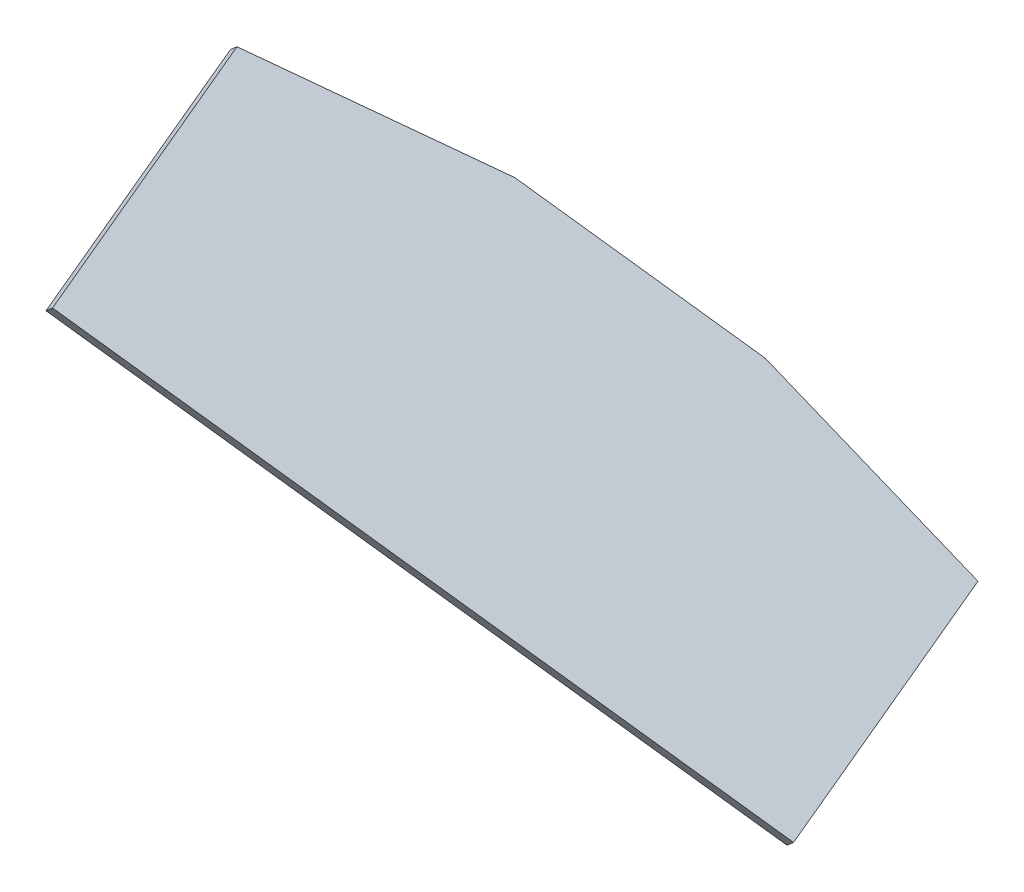
ISO-10303-21;
HEADER;
FILE_DESCRIPTION(('STEP AP214'),'2;1');
FILE_NAME('part.step','',(''),(''),'','','');
FILE_SCHEMA(('AUTOMOTIVE_DESIGN { 1 0 10303 214 1 1 1 1 }'));
ENDSEC;
DATA;
#1=APPLICATION_CONTEXT('core data for automotive mechanical design processes');
#2=APPLICATION_PROTOCOL_DEFINITION('international standard','automotive_design',2000,#1);
#3=PRODUCT_CONTEXT('',#1,'mechanical');
#4=PRODUCT('Part','Part','',(#3));
#5=PRODUCT_RELATED_PRODUCT_CATEGORY('part','',(#4));
#6=PRODUCT_DEFINITION_FORMATION('','',#4);
#7=PRODUCT_DEFINITION_CONTEXT('part definition',#1,'design');
#8=PRODUCT_DEFINITION('design','',#6,#7);
#9=PRODUCT_DEFINITION_SHAPE('','',#8);
#10=(LENGTH_UNIT() NAMED_UNIT(*) SI_UNIT(.MILLI.,.METRE.));
#11=(NAMED_UNIT(*) PLANE_ANGLE_UNIT() SI_UNIT($,.RADIAN.));
#12=(NAMED_UNIT(*) SI_UNIT($,.STERADIAN.) SOLID_ANGLE_UNIT());
#13=UNCERTAINTY_MEASURE_WITH_UNIT(LENGTH_MEASURE(1.E-05),#10,'distance_accuracy_value','');
#14=(GEOMETRIC_REPRESENTATION_CONTEXT(3) GLOBAL_UNCERTAINTY_ASSIGNED_CONTEXT((#13)) GLOBAL_UNIT_ASSIGNED_CONTEXT((#10,
#11,#12)) REPRESENTATION_CONTEXT('',''));
#15=CARTESIAN_POINT('',(0.,0.,0.));
#16=DIRECTION('',(0.,0.,1.));
#17=DIRECTION('',(1.,0.,0.));
#18=AXIS2_PLACEMENT_3D('',#15,#16,#17);
#19=CARTESIAN_POINT('',(77.125,93.9036596711508,-228.692497505547));
#20=DIRECTION('',(0.764698263232688,-0.521321264602428,-0.378762069487213));
#21=DIRECTION('',(-0.625373831276623,-0.458663702326716,-0.631296427458882));
#22=AXIS2_PLACEMENT_3D('',#19,#20,#21);
#23=PLANE('',#22);
#24=DIRECTION('',(0.,0.587785252292485,-0.809016994374939));
#25=VECTOR('',#24,1.);
#26=CARTESIAN_POINT('',(70.6811147883525,40.6943005825095,-168.46592157137));
#27=LINE('',#26,#25);
#28=CARTESIAN_POINT('',(70.6811147883525,40.6943005825095,-168.46592157137));
#29=VERTEX_POINT('',#28);
#30=CARTESIAN_POINT('',(70.6811147883524,80.6636977383983,-223.479077188866));
#31=VERTEX_POINT('',#30);
#32=EDGE_CURVE('E107',#29,#31,#27,.T.);
#33=ORIENTED_EDGE('',*,*,#32,.T.);
#34=DIRECTION('',(0.644388521164763,0.618653890524246,0.449478361581849));
#35=VECTOR('',#34,1.);
#36=CARTESIAN_POINT('',(-82.7169306328023,-66.6081646266785,-330.478348375649));
#37=LINE('',#36,#35);
#38=CARTESIAN_POINT('',(77.125,86.8502366436407,-218.984293573047));
#39=VERTEX_POINT('',#38);
#40=EDGE_CURVE('E55',#31,#39,#37,.T.);
#41=ORIENTED_EDGE('',*,*,#40,.T.);
#42=DIRECTION('',(0.,-0.587785252292485,0.809016994374939));
#43=VECTOR('',#42,1.);
#44=CARTESIAN_POINT('',(77.1250000000001,46.880839487752,-163.971137955552));
#45=LINE('',#44,#43);
#46=CARTESIAN_POINT('',(77.1250000000002,46.8808394877519,-163.971137955552));
#47=VERTEX_POINT('',#46);
#48=EDGE_CURVE('E104',#39,#47,#45,.T.);
#49=ORIENTED_EDGE('',*,*,#48,.T.);
#50=DIRECTION('',(-0.644388521164763,-0.618653890524245,-0.449478361581851));
#51=VECTOR('',#50,1.);
#52=CARTESIAN_POINT('',(77.1250000000002,46.8808394877519,-163.971137955552));
#53=LINE('',#52,#51);
#54=EDGE_CURVE('E119',#47,#29,#53,.T.);
#55=ORIENTED_EDGE('',*,*,#54,.T.);
#56=EDGE_LOOP('',(#33,#41,#49,#55));
#57=FACE_BOUND('',#56,.T.);
#58=ADVANCED_FACE('F41',(#57),#23,.T.);
#59=CARTESIAN_POINT('',(-74.9030573941762,150.523626383511,-88.6702455547834));
#60=DIRECTION('',(-0.644388521164763,-0.618653890524246,-0.449478361581849));
#61=DIRECTION('',(-0.74846865397643,0.389801645525365,0.53651593747104));
#62=AXIS2_PLACEMENT_3D('',#59,#60,#61);
#63=PLANE('',#62);
#64=DIRECTION('',(-0.75160065432839,0.620714254504241,0.223182146840603));
#65=VECTOR('',#64,1.);
#66=CARTESIAN_POINT('',(37.3417211139579,119.70551444745,-207.170948894577));
#67=LINE('',#66,#65);
#68=CARTESIAN_POINT('',(28.1843111531069,127.268220605707,-204.451725058365));
#69=VERTEX_POINT('',#68);
#70=EDGE_CURVE('E91',#39,#69,#67,.T.);
#71=ORIENTED_EDGE('',*,*,#70,.T.);
#72=DIRECTION('',(0.764698263232688,-0.521321264602428,-0.378762069487212));
#73=VECTOR('',#72,1.);
#74=CARTESIAN_POINT('',(-74.9030573941763,197.54644656691,-153.391605104779));
#75=LINE('',#74,#73);
#76=CARTESIAN_POINT('',(-21.7404259414602,161.303641278768,-179.723544480832));
#77=VERTEX_POINT('',#76);
#78=EDGE_CURVE('E128',#77,#69,#75,.T.);
#79=ORIENTED_EDGE('',*,*,#78,.F.);
#80=DIRECTION('',(0.75160065432839,-0.404070088366071,-0.521367260288726));
#81=VECTOR('',#80,1.);
#82=CARTESIAN_POINT('',(-30.8978359023101,166.226781553827,-173.371269885096));
#83=LINE('',#82,#81);
#84=CARTESIAN_POINT('',(-70.6811147883525,187.614779185813,-145.774568101151));
#85=VERTEX_POINT('',#84);
#86=EDGE_CURVE('E146',#85,#77,#83,.T.);
#87=ORIENTED_EDGE('',*,*,#86,.F.);
#88=DIRECTION('',(0.,-0.587785252292485,0.809016994374939));
#89=VECTOR('',#88,1.);
#90=CARTESIAN_POINT('',(-70.6811147883524,147.645382029924,-90.7614124836554));
#91=LINE('',#90,#89);
#92=CARTESIAN_POINT('',(-70.6811147883524,147.645382029924,-90.7614124836554));
#93=VERTEX_POINT('',#92);
#94=EDGE_CURVE('E129',#85,#93,#91,.T.);
#95=ORIENTED_EDGE('',*,*,#94,.T.);
#96=DIRECTION('',(0.764698263232688,-0.521321264602428,-0.378762069487212));
#97=VECTOR('',#96,1.);
#98=CARTESIAN_POINT('',(-74.9030573941762,150.523626383511,-88.6702455547834));
#99=LINE('',#98,#97);
#100=EDGE_CURVE('E111',#93,#47,#99,.T.);
#101=ORIENTED_EDGE('',*,*,#100,.T.);
#102=ORIENTED_EDGE('',*,*,#48,.F.);
#103=EDGE_LOOP('',(#71,#79,#87,#95,#101,#102));
#104=FACE_BOUND('',#103,.T.);
#105=ADVANCED_FACE('F109',(#104),#63,.F.);
#106=CARTESIAN_POINT('',(-81.346942605824,191.359907661667,-157.886388720597));
#107=DIRECTION('',(0.,-0.587785252292485,0.809016994374938));
#108=DIRECTION('',(0.,-0.809016994374938,-0.587785252292485));
#109=AXIS2_PLACEMENT_3D('',#106,#107,#108);
#110=PLANE('',#109);
#111=DIRECTION('',(0.644388521164763,0.618653890524246,0.449478361581849));
#112=VECTOR('',#111,1.);
#113=CARTESIAN_POINT('',(-131.657619479695,-26.1901806646123,-315.945779860966));
#114=LINE('',#113,#112);
#115=CARTESIAN_POINT('',(21.7404259414592,121.081681700464,-208.946508674183));
#116=VERTEX_POINT('',#115);
#117=EDGE_CURVE('E94',#116,#69,#114,.T.);
#118=ORIENTED_EDGE('',*,*,#117,.F.);
#119=DIRECTION('',(0.764698263232688,-0.521321264602428,-0.378762069487212));
#120=VECTOR('',#119,1.);
#121=CARTESIAN_POINT('',(-81.346942605824,191.359907661667,-157.886388720597));
#122=LINE('',#121,#120);
#123=CARTESIAN_POINT('',(-28.1843111531073,155.117102373525,-184.218328096651));
#124=VERTEX_POINT('',#123);
#125=EDGE_CURVE('E127',#124,#116,#122,.T.);
#126=ORIENTED_EDGE('',*,*,#125,.F.);
#127=DIRECTION('',(0.644388521164763,0.618653890524246,0.449478361581849));
#128=VECTOR('',#127,1.);
#129=CARTESIAN_POINT('',(-181.582356574263,7.84524000844841,-291.217599283434));
#130=LINE('',#129,#128);
#131=EDGE_CURVE('E63',#124,#77,#130,.T.);
#132=ORIENTED_EDGE('',*,*,#131,.T.);
#133=ORIENTED_EDGE('',*,*,#78,.T.);
#134=EDGE_LOOP('',(#118,#126,#132,#133));
#135=FACE_BOUND('',#134,.T.);
#136=ADVANCED_FACE('F161',(#135),#110,.F.);
#137=CARTESIAN_POINT('',(-81.3469426058238,144.337087478268,-93.1650291706019));
#138=DIRECTION('',(0.644388521164763,0.618653890524246,0.449478361581849));
#139=DIRECTION('',(0.74846865397643,-0.389801645525365,-0.53651593747104));
#140=AXIS2_PLACEMENT_3D('',#137,#138,#139);
#141=PLANE('',#140);
#142=DIRECTION('',(-0.75160065432839,0.620714254504241,0.223182146840603));
#143=VECTOR('',#142,1.);
#144=CARTESIAN_POINT('',(-66.7649514822802,194.17441924775,-182.66550422506));
#145=LINE('',#144,#143);
#146=EDGE_CURVE('E12',#31,#116,#145,.T.);
#147=ORIENTED_EDGE('',*,*,#146,.F.);
#148=ORIENTED_EDGE('',*,*,#32,.F.);
#149=DIRECTION('',(0.764698263232688,-0.521321264602428,-0.378762069487212));
#150=VECTOR('',#149,1.);
#151=CARTESIAN_POINT('',(-81.3469426058238,144.337087478268,-93.1650291706019));
#152=LINE('',#151,#150);
#153=CARTESIAN_POINT('',(-77.125,141.458843124682,-95.2561960994739));
#154=VERTEX_POINT('',#153);
#155=EDGE_CURVE('E117',#154,#29,#152,.T.);
#156=ORIENTED_EDGE('',*,*,#155,.F.);
#157=DIRECTION('',(0.,0.587785252292485,-0.809016994374939));
#158=VECTOR('',#157,1.);
#159=CARTESIAN_POINT('',(-77.125,141.458843124682,-95.2561960994739));
#160=LINE('',#159,#158);
#161=CARTESIAN_POINT('',(-77.1250000000001,181.428240280571,-150.26935171697));
#162=VERTEX_POINT('',#161);
#163=EDGE_CURVE('E124',#154,#162,#160,.T.);
#164=ORIENTED_EDGE('',*,*,#163,.T.);
#165=DIRECTION('',(0.75160065432839,-0.40407008836607,-0.521367260288726));
#166=VECTOR('',#165,1.);
#167=CARTESIAN_POINT('',(-90.6223299557826,188.684576842455,-140.90657921307));
#168=LINE('',#167,#166);
#169=EDGE_CURVE('E49',#162,#124,#168,.T.);
#170=ORIENTED_EDGE('',*,*,#169,.T.);
#171=ORIENTED_EDGE('',*,*,#125,.T.);
#172=EDGE_LOOP('',(#147,#148,#156,#164,#170,#171));
#173=FACE_BOUND('',#172,.T.);
#174=ADVANCED_FACE('F157',(#173),#141,.F.);
#175=CARTESIAN_POINT('',(-73.903057394176,50.382271271086,36.6048627359479));
#176=DIRECTION('',(0.764698263232688,-0.521321264602428,-0.378762069487212));
#177=DIRECTION('',(-0.625373831276623,-0.458663702326717,-0.631296427458882));
#178=AXIS2_PLACEMENT_3D('',#175,#176,#177);
#179=PLANE('',#178);
#180=ORIENTED_EDGE('',*,*,#94,.F.);
#181=DIRECTION('',(0.644388521164763,0.618653890524246,0.449478361581849));
#182=VECTOR('',#181,1.);
#183=CARTESIAN_POINT('',(-230.523045421155,34.1563779154942,-257.268622903753));
#184=LINE('',#183,#182);
#185=EDGE_CURVE('E150',#162,#85,#184,.T.);
#186=ORIENTED_EDGE('',*,*,#185,.F.);
#187=ORIENTED_EDGE('',*,*,#163,.F.);
#188=DIRECTION('',(-0.644388521164763,-0.618653890524245,-0.449478361581851));
#189=VECTOR('',#188,1.);
#190=CARTESIAN_POINT('',(-70.6811147883524,147.645382029924,-90.7614124836554));
#191=LINE('',#190,#189);
#192=EDGE_CURVE('E114',#93,#154,#191,.T.);
#193=ORIENTED_EDGE('',*,*,#192,.F.);
#194=EDGE_LOOP('',(#180,#186,#187,#193));
#195=FACE_BOUND('',#194,.T.);
#196=ADVANCED_FACE('F43',(#195),#179,.F.);
#197=CARTESIAN_POINT('',(-74.9030573941762,150.523626383511,-88.6702455547834));
#198=DIRECTION('',(0.,0.587785252292485,-0.809016994374938));
#199=DIRECTION('',(0.,0.809016994374938,0.587785252292485));
#200=AXIS2_PLACEMENT_3D('',#197,#198,#199);
#201=PLANE('',#200);
#202=ORIENTED_EDGE('',*,*,#100,.F.);
#203=ORIENTED_EDGE('',*,*,#192,.T.);
#204=ORIENTED_EDGE('',*,*,#155,.T.);
#205=ORIENTED_EDGE('',*,*,#54,.F.);
#206=EDGE_LOOP('',(#202,#203,#204,#205));
#207=FACE_BOUND('',#206,.T.);
#208=ADVANCED_FACE('F153',(#207),#201,.F.);
#209=CARTESIAN_POINT('',(-190.739766535112,12.7683802835075,-284.865324687698));
#210=DIRECTION('',(0.140925122686573,-0.673791308512547,0.725358795609955));
#211=DIRECTION('',(0.,-0.732670660309056,-0.680583355307997));
#212=AXIS2_PLACEMENT_3D('',#209,#210,#211);
#213=PLANE('',#212);
#214=ORIENTED_EDGE('',*,*,#185,.T.);
#215=ORIENTED_EDGE('',*,*,#86,.T.);
#216=ORIENTED_EDGE('',*,*,#131,.F.);
#217=ORIENTED_EDGE('',*,*,#169,.F.);
#218=EDGE_LOOP('',(#214,#215,#216,#217));
#219=FACE_BOUND('',#218,.T.);
#220=ADVANCED_FACE('F166',(#219),#213,.F.);
#221=CARTESIAN_POINT('',(-122.500209518844,-33.7528868228694,-318.665003697178));
#222=DIRECTION('',(0.140925122686573,0.481644244224364,-0.864961809446704));
#223=DIRECTION('',(0.,0.873680920263091,0.486499382906329));
#224=AXIS2_PLACEMENT_3D('',#221,#222,#223);
#225=PLANE('',#224);
#226=ORIENTED_EDGE('',*,*,#146,.T.);
#227=ORIENTED_EDGE('',*,*,#117,.T.);
#228=ORIENTED_EDGE('',*,*,#70,.F.);
#229=ORIENTED_EDGE('',*,*,#40,.F.);
#230=EDGE_LOOP('',(#226,#227,#228,#229));
#231=FACE_BOUND('',#230,.T.);
#232=ADVANCED_FACE('F92',(#231),#225,.T.);
#233=CLOSED_SHELL('',(#58,#105,#136,#174,#196,#208,#220,#232));
#234=MANIFOLD_SOLID_BREP('B2',#233);
#235=ADVANCED_BREP_SHAPE_REPRESENTATION('',(#18,#234),#14);
#236=SHAPE_DEFINITION_REPRESENTATION(#9,#235);
ENDSEC;
END-ISO-10303-21;
